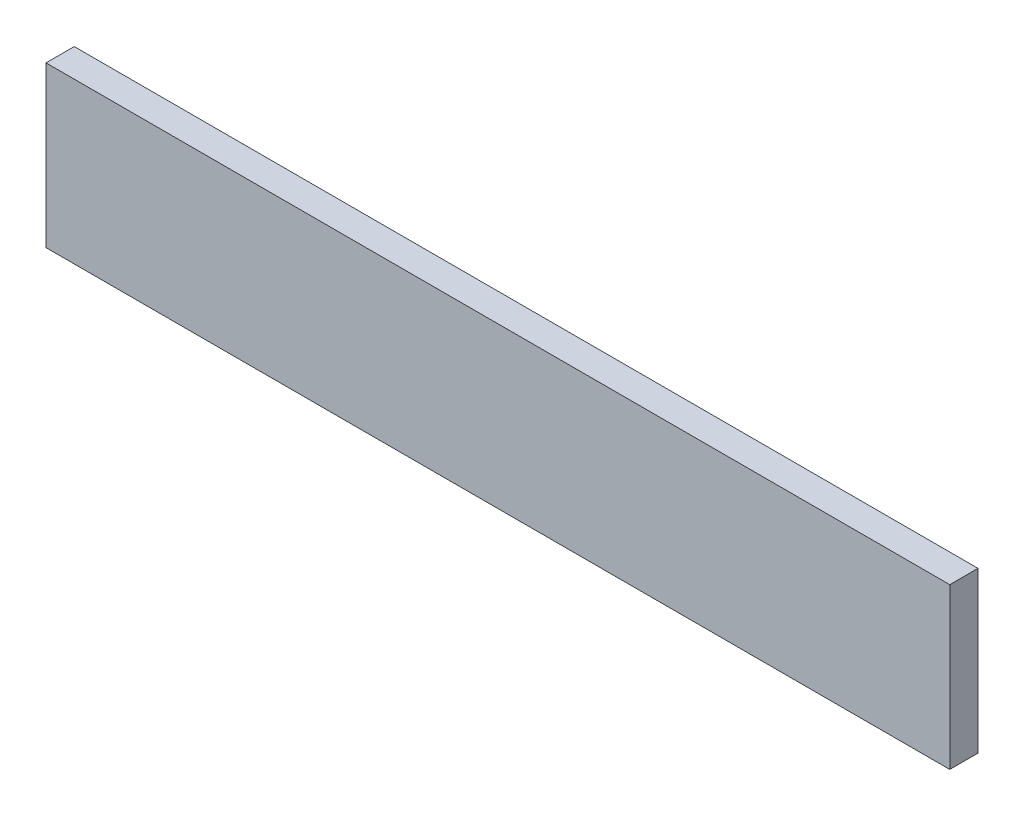
ISO-10303-21;
HEADER;
FILE_DESCRIPTION(('STEP AP214'),'2;1');
FILE_NAME('part.step','',(''),(''),'','','');
FILE_SCHEMA(('AUTOMOTIVE_DESIGN { 1 0 10303 214 1 1 1 1 }'));
ENDSEC;
DATA;
#1=APPLICATION_CONTEXT('core data for automotive mechanical design processes');
#2=APPLICATION_PROTOCOL_DEFINITION('international standard','automotive_design',2000,#1);
#3=PRODUCT_CONTEXT('',#1,'mechanical');
#4=PRODUCT('Part','Part','',(#3));
#5=PRODUCT_RELATED_PRODUCT_CATEGORY('part','',(#4));
#6=PRODUCT_DEFINITION_FORMATION('','',#4);
#7=PRODUCT_DEFINITION_CONTEXT('part definition',#1,'design');
#8=PRODUCT_DEFINITION('design','',#6,#7);
#9=PRODUCT_DEFINITION_SHAPE('','',#8);
#10=(LENGTH_UNIT() NAMED_UNIT(*) SI_UNIT(.MILLI.,.METRE.));
#11=(NAMED_UNIT(*) PLANE_ANGLE_UNIT() SI_UNIT($,.RADIAN.));
#12=(NAMED_UNIT(*) SI_UNIT($,.STERADIAN.) SOLID_ANGLE_UNIT());
#13=UNCERTAINTY_MEASURE_WITH_UNIT(LENGTH_MEASURE(1.E-05),#10,'distance_accuracy_value','');
#14=(GEOMETRIC_REPRESENTATION_CONTEXT(3) GLOBAL_UNCERTAINTY_ASSIGNED_CONTEXT((#13)) GLOBAL_UNIT_ASSIGNED_CONTEXT((#10,
#11,#12)) REPRESENTATION_CONTEXT('',''));
#15=CARTESIAN_POINT('',(0.,0.,0.));
#16=DIRECTION('',(0.,0.,1.));
#17=DIRECTION('',(1.,0.,0.));
#18=AXIS2_PLACEMENT_3D('',#15,#16,#17);
#19=CARTESIAN_POINT('',(0.,107.95,19.05));
#20=DIRECTION('',(1.,0.,0.));
#21=DIRECTION('',(0.,1.,0.));
#22=AXIS2_PLACEMENT_3D('',#19,#20,#21);
#23=PLANE('',#22);
#24=DIRECTION('',(0.,-1.,0.));
#25=VECTOR('',#24,1.);
#26=CARTESIAN_POINT('',(0.,107.95,0.));
#27=LINE('',#26,#25);
#28=CARTESIAN_POINT('',(0.,107.95,0.));
#29=VERTEX_POINT('',#28);
#30=CARTESIAN_POINT('',(0.,0.,0.));
#31=VERTEX_POINT('',#30);
#32=EDGE_CURVE('E96',#29,#31,#27,.T.);
#33=ORIENTED_EDGE('',*,*,#32,.T.);
#34=DIRECTION('',(0.,0.,-1.));
#35=VECTOR('',#34,1.);
#36=CARTESIAN_POINT('',(0.,0.,19.05));
#37=LINE('',#36,#35);
#38=CARTESIAN_POINT('',(0.,0.,19.05));
#39=VERTEX_POINT('',#38);
#40=EDGE_CURVE('E11',#39,#31,#37,.T.);
#41=ORIENTED_EDGE('',*,*,#40,.F.);
#42=DIRECTION('',(0.,-1.,0.));
#43=VECTOR('',#42,1.);
#44=CARTESIAN_POINT('',(0.,107.95,19.05));
#45=LINE('',#44,#43);
#46=CARTESIAN_POINT('',(0.,107.95,19.05));
#47=VERTEX_POINT('',#46);
#48=EDGE_CURVE('E84',#47,#39,#45,.T.);
#49=ORIENTED_EDGE('',*,*,#48,.F.);
#50=DIRECTION('',(0.,0.,-1.));
#51=VECTOR('',#50,1.);
#52=CARTESIAN_POINT('',(0.,107.95,19.05));
#53=LINE('',#52,#51);
#54=EDGE_CURVE('E92',#47,#29,#53,.T.);
#55=ORIENTED_EDGE('',*,*,#54,.T.);
#56=EDGE_LOOP('',(#33,#41,#49,#55));
#57=FACE_BOUND('',#56,.T.);
#58=ADVANCED_FACE('F33',(#57),#23,.F.);
#59=CARTESIAN_POINT('',(0.,0.,19.05));
#60=DIRECTION('',(0.,1.,0.));
#61=DIRECTION('',(0.,0.,1.));
#62=AXIS2_PLACEMENT_3D('',#59,#60,#61);
#63=PLANE('',#62);
#64=DIRECTION('',(1.,0.,0.));
#65=VECTOR('',#64,1.);
#66=CARTESIAN_POINT('',(0.,0.,0.));
#67=LINE('',#66,#65);
#68=CARTESIAN_POINT('',(609.6,0.,0.));
#69=VERTEX_POINT('',#68);
#70=EDGE_CURVE('E88',#31,#69,#67,.T.);
#71=ORIENTED_EDGE('',*,*,#70,.T.);
#72=DIRECTION('',(0.,0.,-1.));
#73=VECTOR('',#72,1.);
#74=CARTESIAN_POINT('',(609.6,0.,19.05));
#75=LINE('',#74,#73);
#76=CARTESIAN_POINT('',(609.6,0.,19.05));
#77=VERTEX_POINT('',#76);
#78=EDGE_CURVE('E41',#77,#69,#75,.T.);
#79=ORIENTED_EDGE('',*,*,#78,.F.);
#80=DIRECTION('',(1.,0.,0.));
#81=VECTOR('',#80,1.);
#82=CARTESIAN_POINT('',(0.,0.,19.05));
#83=LINE('',#82,#81);
#84=EDGE_CURVE('E79',#39,#77,#83,.T.);
#85=ORIENTED_EDGE('',*,*,#84,.F.);
#86=ORIENTED_EDGE('',*,*,#40,.T.);
#87=EDGE_LOOP('',(#71,#79,#85,#86));
#88=FACE_BOUND('',#87,.T.);
#89=ADVANCED_FACE('F87',(#88),#63,.F.);
#90=CARTESIAN_POINT('',(609.6,107.95,19.05));
#91=DIRECTION('',(-1.,0.,0.));
#92=DIRECTION('',(0.,0.,1.));
#93=AXIS2_PLACEMENT_3D('',#90,#91,#92);
#94=PLANE('',#93);
#95=DIRECTION('',(0.,1.,0.));
#96=VECTOR('',#95,1.);
#97=CARTESIAN_POINT('',(609.6,107.95,0.));
#98=LINE('',#97,#96);
#99=CARTESIAN_POINT('',(609.6,107.95,0.));
#100=VERTEX_POINT('',#99);
#101=EDGE_CURVE('E66',#69,#100,#98,.T.);
#102=ORIENTED_EDGE('',*,*,#101,.T.);
#103=DIRECTION('',(0.,0.,-1.));
#104=VECTOR('',#103,1.);
#105=CARTESIAN_POINT('',(609.6,107.95,19.05));
#106=LINE('',#105,#104);
#107=CARTESIAN_POINT('',(609.6,107.95,19.05));
#108=VERTEX_POINT('',#107);
#109=EDGE_CURVE('E89',#108,#100,#106,.T.);
#110=ORIENTED_EDGE('',*,*,#109,.F.);
#111=DIRECTION('',(0.,1.,0.));
#112=VECTOR('',#111,1.);
#113=CARTESIAN_POINT('',(609.6,107.95,19.05));
#114=LINE('',#113,#112);
#115=EDGE_CURVE('E82',#77,#108,#114,.T.);
#116=ORIENTED_EDGE('',*,*,#115,.F.);
#117=ORIENTED_EDGE('',*,*,#78,.T.);
#118=EDGE_LOOP('',(#102,#110,#116,#117));
#119=FACE_BOUND('',#118,.T.);
#120=ADVANCED_FACE('F90',(#119),#94,.F.);
#121=CARTESIAN_POINT('',(0.,107.95,19.05));
#122=DIRECTION('',(0.,-1.,0.));
#123=DIRECTION('',(0.,0.,-1.));
#124=AXIS2_PLACEMENT_3D('',#121,#122,#123);
#125=PLANE('',#124);
#126=DIRECTION('',(-1.,0.,0.));
#127=VECTOR('',#126,1.);
#128=CARTESIAN_POINT('',(0.,107.95,0.));
#129=LINE('',#128,#127);
#130=EDGE_CURVE('E72',#100,#29,#129,.T.);
#131=ORIENTED_EDGE('',*,*,#130,.T.);
#132=ORIENTED_EDGE('',*,*,#54,.F.);
#133=DIRECTION('',(-1.,0.,0.));
#134=VECTOR('',#133,1.);
#135=CARTESIAN_POINT('',(0.,107.95,19.05));
#136=LINE('',#135,#134);
#137=EDGE_CURVE('E49',#108,#47,#136,.T.);
#138=ORIENTED_EDGE('',*,*,#137,.F.);
#139=ORIENTED_EDGE('',*,*,#109,.T.);
#140=EDGE_LOOP('',(#131,#132,#138,#139));
#141=FACE_BOUND('',#140,.T.);
#142=ADVANCED_FACE('F103',(#141),#125,.F.);
#143=CARTESIAN_POINT('',(0.,0.,19.05));
#144=DIRECTION('',(0.,0.,1.));
#145=DIRECTION('',(1.,0.,0.));
#146=AXIS2_PLACEMENT_3D('',#143,#144,#145);
#147=PLANE('',#146);
#148=ORIENTED_EDGE('',*,*,#48,.T.);
#149=ORIENTED_EDGE('',*,*,#84,.T.);
#150=ORIENTED_EDGE('',*,*,#115,.T.);
#151=ORIENTED_EDGE('',*,*,#137,.T.);
#152=EDGE_LOOP('',(#148,#149,#150,#151));
#153=FACE_BOUND('',#152,.T.);
#154=ADVANCED_FACE('F80',(#153),#147,.T.);
#155=CARTESIAN_POINT('',(0.,0.,0.));
#156=DIRECTION('',(0.,0.,1.));
#157=DIRECTION('',(1.,0.,0.));
#158=AXIS2_PLACEMENT_3D('',#155,#156,#157);
#159=PLANE('',#158);
#160=ORIENTED_EDGE('',*,*,#32,.F.);
#161=ORIENTED_EDGE('',*,*,#130,.F.);
#162=ORIENTED_EDGE('',*,*,#101,.F.);
#163=ORIENTED_EDGE('',*,*,#70,.F.);
#164=EDGE_LOOP('',(#160,#161,#162,#163));
#165=FACE_BOUND('',#164,.T.);
#166=ADVANCED_FACE('F106',(#165),#159,.F.);
#167=CLOSED_SHELL('',(#58,#89,#120,#142,#154,#166));
#168=MANIFOLD_SOLID_BREP('B2',#167);
#169=ADVANCED_BREP_SHAPE_REPRESENTATION('',(#18,#168),#14);
#170=SHAPE_DEFINITION_REPRESENTATION(#9,#169);
ENDSEC;
END-ISO-10303-21;
